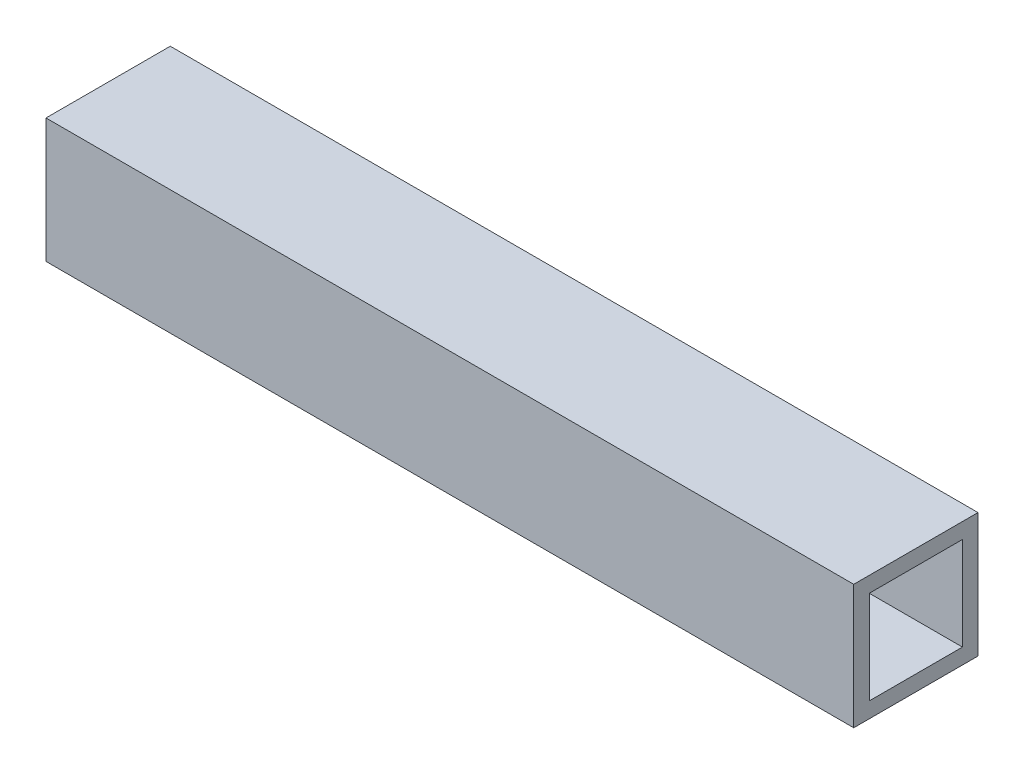
ISO-10303-21;
HEADER;
FILE_DESCRIPTION(('STEP AP214'),'2;1');
FILE_NAME('part.step','',(''),(''),'','','');
FILE_SCHEMA(('AUTOMOTIVE_DESIGN { 1 0 10303 214 1 1 1 1 }'));
ENDSEC;
DATA;
#1=APPLICATION_CONTEXT('core data for automotive mechanical design processes');
#2=APPLICATION_PROTOCOL_DEFINITION('international standard','automotive_design',2000,#1);
#3=PRODUCT_CONTEXT('',#1,'mechanical');
#4=PRODUCT('Part','Part','',(#3));
#5=PRODUCT_RELATED_PRODUCT_CATEGORY('part','',(#4));
#6=PRODUCT_DEFINITION_FORMATION('','',#4);
#7=PRODUCT_DEFINITION_CONTEXT('part definition',#1,'design');
#8=PRODUCT_DEFINITION('design','',#6,#7);
#9=PRODUCT_DEFINITION_SHAPE('','',#8);
#10=(LENGTH_UNIT() NAMED_UNIT(*) SI_UNIT(.MILLI.,.METRE.));
#11=(NAMED_UNIT(*) PLANE_ANGLE_UNIT() SI_UNIT($,.RADIAN.));
#12=(NAMED_UNIT(*) SI_UNIT($,.STERADIAN.) SOLID_ANGLE_UNIT());
#13=UNCERTAINTY_MEASURE_WITH_UNIT(LENGTH_MEASURE(1.E-05),#10,'distance_accuracy_value','');
#14=(GEOMETRIC_REPRESENTATION_CONTEXT(3) GLOBAL_UNCERTAINTY_ASSIGNED_CONTEXT((#13)) GLOBAL_UNIT_ASSIGNED_CONTEXT((#10,
#11,#12)) REPRESENTATION_CONTEXT('',''));
#15=CARTESIAN_POINT('',(0.,0.,0.));
#16=DIRECTION('',(0.,0.,1.));
#17=DIRECTION('',(1.,0.,0.));
#18=AXIS2_PLACEMENT_3D('',#15,#16,#17);
#19=CARTESIAN_POINT('',(165.1,-209.55,22.4741790443659));
#20=DIRECTION('',(0.,-1.,0.));
#21=DIRECTION('',(0.,0.,-1.));
#22=AXIS2_PLACEMENT_3D('',#19,#20,#21);
#23=PLANE('',#22);
#24=DIRECTION('',(0.,0.,1.));
#25=VECTOR('',#24,1.);
#26=CARTESIAN_POINT('',(-165.1,-209.55,22.4741790443659));
#27=LINE('',#26,#25);
#28=CARTESIAN_POINT('',(-165.1,-209.55,6.35));
#29=VERTEX_POINT('',#28);
#30=CARTESIAN_POINT('',(-165.1,-209.55,44.45));
#31=VERTEX_POINT('',#30);
#32=EDGE_CURVE('E156',#29,#31,#27,.T.);
#33=ORIENTED_EDGE('',*,*,#32,.T.);
#34=DIRECTION('',(-1.,0.,0.));
#35=VECTOR('',#34,1.);
#36=CARTESIAN_POINT('',(165.1,-209.55,44.45));
#37=LINE('',#36,#35);
#38=CARTESIAN_POINT('',(165.1,-209.55,44.45));
#39=VERTEX_POINT('',#38);
#40=EDGE_CURVE('E11',#39,#31,#37,.T.);
#41=ORIENTED_EDGE('',*,*,#40,.F.);
#42=DIRECTION('',(0.,0.,1.));
#43=VECTOR('',#42,1.);
#44=CARTESIAN_POINT('',(165.1,-209.55,22.4741790443659));
#45=LINE('',#44,#43);
#46=CARTESIAN_POINT('',(165.1,-209.55,6.35));
#47=VERTEX_POINT('',#46);
#48=EDGE_CURVE('E118',#47,#39,#45,.T.);
#49=ORIENTED_EDGE('',*,*,#48,.F.);
#50=DIRECTION('',(-1.,0.,0.));
#51=VECTOR('',#50,1.);
#52=CARTESIAN_POINT('',(165.1,-209.55,6.35));
#53=LINE('',#52,#51);
#54=EDGE_CURVE('E41',#47,#29,#53,.T.);
#55=ORIENTED_EDGE('',*,*,#54,.T.);
#56=EDGE_LOOP('',(#33,#41,#49,#55));
#57=FACE_BOUND('',#56,.T.);
#58=ADVANCED_FACE('F16',(#57),#23,.F.);
#59=CARTESIAN_POINT('',(165.1,-190.5,44.45));
#60=DIRECTION('',(0.,0.,1.));
#61=DIRECTION('',(1.,0.,0.));
#62=AXIS2_PLACEMENT_3D('',#59,#60,#61);
#63=PLANE('',#62);
#64=DIRECTION('',(0.,1.,0.));
#65=VECTOR('',#64,1.);
#66=CARTESIAN_POINT('',(-165.1,-190.5,44.45));
#67=LINE('',#66,#65);
#68=CARTESIAN_POINT('',(-165.1,-171.45,44.45));
#69=VERTEX_POINT('',#68);
#70=EDGE_CURVE('E125',#31,#69,#67,.T.);
#71=ORIENTED_EDGE('',*,*,#70,.T.);
#72=DIRECTION('',(-1.,0.,0.));
#73=VECTOR('',#72,1.);
#74=CARTESIAN_POINT('',(165.1,-171.45,44.45));
#75=LINE('',#74,#73);
#76=CARTESIAN_POINT('',(165.1,-171.45,44.45));
#77=VERTEX_POINT('',#76);
#78=EDGE_CURVE('E27',#77,#69,#75,.T.);
#79=ORIENTED_EDGE('',*,*,#78,.F.);
#80=DIRECTION('',(0.,1.,0.));
#81=VECTOR('',#80,1.);
#82=CARTESIAN_POINT('',(165.1,-190.5,44.45));
#83=LINE('',#82,#81);
#84=EDGE_CURVE('E112',#39,#77,#83,.T.);
#85=ORIENTED_EDGE('',*,*,#84,.F.);
#86=ORIENTED_EDGE('',*,*,#40,.T.);
#87=EDGE_LOOP('',(#71,#79,#85,#86));
#88=FACE_BOUND('',#87,.T.);
#89=ADVANCED_FACE('F124',(#88),#63,.F.);
#90=CARTESIAN_POINT('',(165.1,-171.45,22.4741790443659));
#91=DIRECTION('',(0.,-1.,0.));
#92=DIRECTION('',(0.,0.,-1.));
#93=AXIS2_PLACEMENT_3D('',#90,#91,#92);
#94=PLANE('',#93);
#95=DIRECTION('',(0.,0.,1.));
#96=VECTOR('',#95,1.);
#97=CARTESIAN_POINT('',(-165.1,-171.45,22.4741790443659));
#98=LINE('',#97,#96);
#99=CARTESIAN_POINT('',(-165.1,-171.45,6.35));
#100=VERTEX_POINT('',#99);
#101=EDGE_CURVE('E161',#100,#69,#98,.T.);
#102=ORIENTED_EDGE('',*,*,#101,.F.);
#103=DIRECTION('',(-1.,0.,0.));
#104=VECTOR('',#103,1.);
#105=CARTESIAN_POINT('',(165.1,-171.45,6.35));
#106=LINE('',#105,#104);
#107=CARTESIAN_POINT('',(165.1,-171.45,6.35));
#108=VERTEX_POINT('',#107);
#109=EDGE_CURVE('E76',#108,#100,#106,.T.);
#110=ORIENTED_EDGE('',*,*,#109,.F.);
#111=DIRECTION('',(0.,0.,1.));
#112=VECTOR('',#111,1.);
#113=CARTESIAN_POINT('',(165.1,-171.45,22.4741790443659));
#114=LINE('',#113,#112);
#115=EDGE_CURVE('E117',#108,#77,#114,.T.);
#116=ORIENTED_EDGE('',*,*,#115,.T.);
#117=ORIENTED_EDGE('',*,*,#78,.T.);
#118=EDGE_LOOP('',(#102,#110,#116,#117));
#119=FACE_BOUND('',#118,.T.);
#120=ADVANCED_FACE('F130',(#119),#94,.T.);
#121=CARTESIAN_POINT('',(165.1,-190.5,50.8));
#122=DIRECTION('',(0.,0.,1.));
#123=DIRECTION('',(1.,0.,0.));
#124=AXIS2_PLACEMENT_3D('',#121,#122,#123);
#125=PLANE('',#124);
#126=DIRECTION('',(0.,1.,0.));
#127=VECTOR('',#126,1.);
#128=CARTESIAN_POINT('',(-165.1,-190.5,50.8));
#129=LINE('',#128,#127);
#130=CARTESIAN_POINT('',(-165.1,-215.9,50.8));
#131=VERTEX_POINT('',#130);
#132=CARTESIAN_POINT('',(-165.1,-165.1,50.8));
#133=VERTEX_POINT('',#132);
#134=EDGE_CURVE('E141',#131,#133,#129,.T.);
#135=ORIENTED_EDGE('',*,*,#134,.F.);
#136=DIRECTION('',(-1.,0.,0.));
#137=VECTOR('',#136,1.);
#138=CARTESIAN_POINT('',(165.1,-215.9,50.8));
#139=LINE('',#138,#137);
#140=CARTESIAN_POINT('',(165.1,-215.9,50.8));
#141=VERTEX_POINT('',#140);
#142=EDGE_CURVE('E20',#141,#131,#139,.T.);
#143=ORIENTED_EDGE('',*,*,#142,.F.);
#144=DIRECTION('',(0.,1.,0.));
#145=VECTOR('',#144,1.);
#146=CARTESIAN_POINT('',(165.1,-190.5,50.8));
#147=LINE('',#146,#145);
#148=CARTESIAN_POINT('',(165.1,-165.1,50.8));
#149=VERTEX_POINT('',#148);
#150=EDGE_CURVE('E168',#141,#149,#147,.T.);
#151=ORIENTED_EDGE('',*,*,#150,.T.);
#152=DIRECTION('',(-1.,0.,0.));
#153=VECTOR('',#152,1.);
#154=CARTESIAN_POINT('',(165.1,-165.1,50.8));
#155=LINE('',#154,#153);
#156=EDGE_CURVE('E137',#149,#133,#155,.T.);
#157=ORIENTED_EDGE('',*,*,#156,.T.);
#158=EDGE_LOOP('',(#135,#143,#151,#157));
#159=FACE_BOUND('',#158,.T.);
#160=ADVANCED_FACE('F18',(#159),#125,.T.);
#161=CARTESIAN_POINT('',(165.1,-215.9,2082.8));
#162=DIRECTION('',(0.,1.,0.));
#163=DIRECTION('',(0.,0.,1.));
#164=AXIS2_PLACEMENT_3D('',#161,#162,#163);
#165=PLANE('',#164);
#166=DIRECTION('',(0.,0.,-1.));
#167=VECTOR('',#166,1.);
#168=CARTESIAN_POINT('',(-165.1,-215.9,2082.8));
#169=LINE('',#168,#167);
#170=CARTESIAN_POINT('',(-165.1,-215.9,0.));
#171=VERTEX_POINT('',#170);
#172=EDGE_CURVE('E145',#131,#171,#169,.T.);
#173=ORIENTED_EDGE('',*,*,#172,.T.);
#174=DIRECTION('',(-1.,0.,0.));
#175=VECTOR('',#174,1.);
#176=CARTESIAN_POINT('',(165.1,-215.9,0.));
#177=LINE('',#176,#175);
#178=CARTESIAN_POINT('',(165.1,-215.9,0.));
#179=VERTEX_POINT('',#178);
#180=EDGE_CURVE('E177',#179,#171,#177,.T.);
#181=ORIENTED_EDGE('',*,*,#180,.F.);
#182=DIRECTION('',(0.,0.,-1.));
#183=VECTOR('',#182,1.);
#184=CARTESIAN_POINT('',(165.1,-215.9,2082.8));
#185=LINE('',#184,#183);
#186=EDGE_CURVE('E190',#141,#179,#185,.T.);
#187=ORIENTED_EDGE('',*,*,#186,.F.);
#188=ORIENTED_EDGE('',*,*,#142,.T.);
#189=EDGE_LOOP('',(#173,#181,#187,#188));
#190=FACE_BOUND('',#189,.T.);
#191=ADVANCED_FACE('F189',(#190),#165,.F.);
#192=CARTESIAN_POINT('',(165.1,-190.5,0.));
#193=DIRECTION('',(0.,0.,1.));
#194=DIRECTION('',(1.,0.,0.));
#195=AXIS2_PLACEMENT_3D('',#192,#193,#194);
#196=PLANE('',#195);
#197=DIRECTION('',(0.,1.,0.));
#198=VECTOR('',#197,1.);
#199=CARTESIAN_POINT('',(-165.1,-190.5,0.));
#200=LINE('',#199,#198);
#201=CARTESIAN_POINT('',(-165.1,-165.1,0.));
#202=VERTEX_POINT('',#201);
#203=EDGE_CURVE('E148',#171,#202,#200,.T.);
#204=ORIENTED_EDGE('',*,*,#203,.T.);
#205=DIRECTION('',(-1.,0.,0.));
#206=VECTOR('',#205,1.);
#207=CARTESIAN_POINT('',(165.1,-165.1,0.));
#208=LINE('',#207,#206);
#209=CARTESIAN_POINT('',(165.1,-165.1,0.));
#210=VERTEX_POINT('',#209);
#211=EDGE_CURVE('E175',#210,#202,#208,.T.);
#212=ORIENTED_EDGE('',*,*,#211,.F.);
#213=DIRECTION('',(0.,1.,0.));
#214=VECTOR('',#213,1.);
#215=CARTESIAN_POINT('',(165.1,-190.5,0.));
#216=LINE('',#215,#214);
#217=EDGE_CURVE('E235',#179,#210,#216,.T.);
#218=ORIENTED_EDGE('',*,*,#217,.F.);
#219=ORIENTED_EDGE('',*,*,#180,.T.);
#220=EDGE_LOOP('',(#204,#212,#218,#219));
#221=FACE_BOUND('',#220,.T.);
#222=ADVANCED_FACE('F202',(#221),#196,.F.);
#223=CARTESIAN_POINT('',(165.1,-165.1,2082.8));
#224=DIRECTION('',(0.,1.,0.));
#225=DIRECTION('',(0.,0.,1.));
#226=AXIS2_PLACEMENT_3D('',#223,#224,#225);
#227=PLANE('',#226);
#228=DIRECTION('',(0.,0.,-1.));
#229=VECTOR('',#228,1.);
#230=CARTESIAN_POINT('',(-165.1,-165.1,2082.8));
#231=LINE('',#230,#229);
#232=EDGE_CURVE('E152',#133,#202,#231,.T.);
#233=ORIENTED_EDGE('',*,*,#232,.F.);
#234=ORIENTED_EDGE('',*,*,#156,.F.);
#235=DIRECTION('',(0.,0.,-1.));
#236=VECTOR('',#235,1.);
#237=CARTESIAN_POINT('',(165.1,-165.1,2082.8));
#238=LINE('',#237,#236);
#239=EDGE_CURVE('E200',#149,#210,#238,.T.);
#240=ORIENTED_EDGE('',*,*,#239,.T.);
#241=ORIENTED_EDGE('',*,*,#211,.T.);
#242=EDGE_LOOP('',(#233,#234,#240,#241));
#243=FACE_BOUND('',#242,.T.);
#244=ADVANCED_FACE('F199',(#243),#227,.T.);
#245=CARTESIAN_POINT('',(165.1,-190.5,6.35));
#246=DIRECTION('',(0.,0.,1.));
#247=DIRECTION('',(1.,0.,0.));
#248=AXIS2_PLACEMENT_3D('',#245,#246,#247);
#249=PLANE('',#248);
#250=DIRECTION('',(0.,1.,0.));
#251=VECTOR('',#250,1.);
#252=CARTESIAN_POINT('',(-165.1,-190.5,6.35));
#253=LINE('',#252,#251);
#254=EDGE_CURVE('E164',#29,#100,#253,.T.);
#255=ORIENTED_EDGE('',*,*,#254,.F.);
#256=ORIENTED_EDGE('',*,*,#54,.F.);
#257=DIRECTION('',(0.,1.,0.));
#258=VECTOR('',#257,1.);
#259=CARTESIAN_POINT('',(165.1,-190.5,6.35));
#260=LINE('',#259,#258);
#261=EDGE_CURVE('E132',#47,#108,#260,.T.);
#262=ORIENTED_EDGE('',*,*,#261,.T.);
#263=ORIENTED_EDGE('',*,*,#109,.T.);
#264=EDGE_LOOP('',(#255,#256,#262,#263));
#265=FACE_BOUND('',#264,.T.);
#266=ADVANCED_FACE('F210',(#265),#249,.T.);
#267=CARTESIAN_POINT('',(165.1,-190.5,1041.4));
#268=DIRECTION('',(1.,0.,0.));
#269=DIRECTION('',(0.,1.,0.));
#270=AXIS2_PLACEMENT_3D('',#267,#268,#269);
#271=PLANE('',#270);
#272=ORIENTED_EDGE('',*,*,#150,.F.);
#273=ORIENTED_EDGE('',*,*,#186,.T.);
#274=ORIENTED_EDGE('',*,*,#217,.T.);
#275=ORIENTED_EDGE('',*,*,#239,.F.);
#276=EDGE_LOOP('',(#272,#273,#274,#275));
#277=FACE_BOUND('',#276,.T.);
#278=ORIENTED_EDGE('',*,*,#48,.T.);
#279=ORIENTED_EDGE('',*,*,#84,.T.);
#280=ORIENTED_EDGE('',*,*,#115,.F.);
#281=ORIENTED_EDGE('',*,*,#261,.F.);
#282=EDGE_LOOP('',(#278,#279,#280,#281));
#283=FACE_BOUND('',#282,.T.);
#284=ADVANCED_FACE('F114',(#277,#283),#271,.T.);
#285=CARTESIAN_POINT('',(-165.1,-190.5,1041.4));
#286=DIRECTION('',(1.,0.,0.));
#287=DIRECTION('',(0.,1.,0.));
#288=AXIS2_PLACEMENT_3D('',#285,#286,#287);
#289=PLANE('',#288);
#290=ORIENTED_EDGE('',*,*,#134,.T.);
#291=ORIENTED_EDGE('',*,*,#232,.T.);
#292=ORIENTED_EDGE('',*,*,#203,.F.);
#293=ORIENTED_EDGE('',*,*,#172,.F.);
#294=EDGE_LOOP('',(#290,#291,#292,#293));
#295=FACE_BOUND('',#294,.T.);
#296=ORIENTED_EDGE('',*,*,#32,.F.);
#297=ORIENTED_EDGE('',*,*,#254,.T.);
#298=ORIENTED_EDGE('',*,*,#101,.T.);
#299=ORIENTED_EDGE('',*,*,#70,.F.);
#300=EDGE_LOOP('',(#296,#297,#298,#299));
#301=FACE_BOUND('',#300,.T.);
#302=ADVANCED_FACE('F193',(#295,#301),#289,.F.);
#303=CLOSED_SHELL('',(#58,#89,#120,#160,#191,#222,#244,#266,#284,#302));
#304=MANIFOLD_SOLID_BREP('B1',#303);
#305=ADVANCED_BREP_SHAPE_REPRESENTATION('',(#18,#304),#14);
#306=SHAPE_DEFINITION_REPRESENTATION(#9,#305);
ENDSEC;
END-ISO-10303-21;
